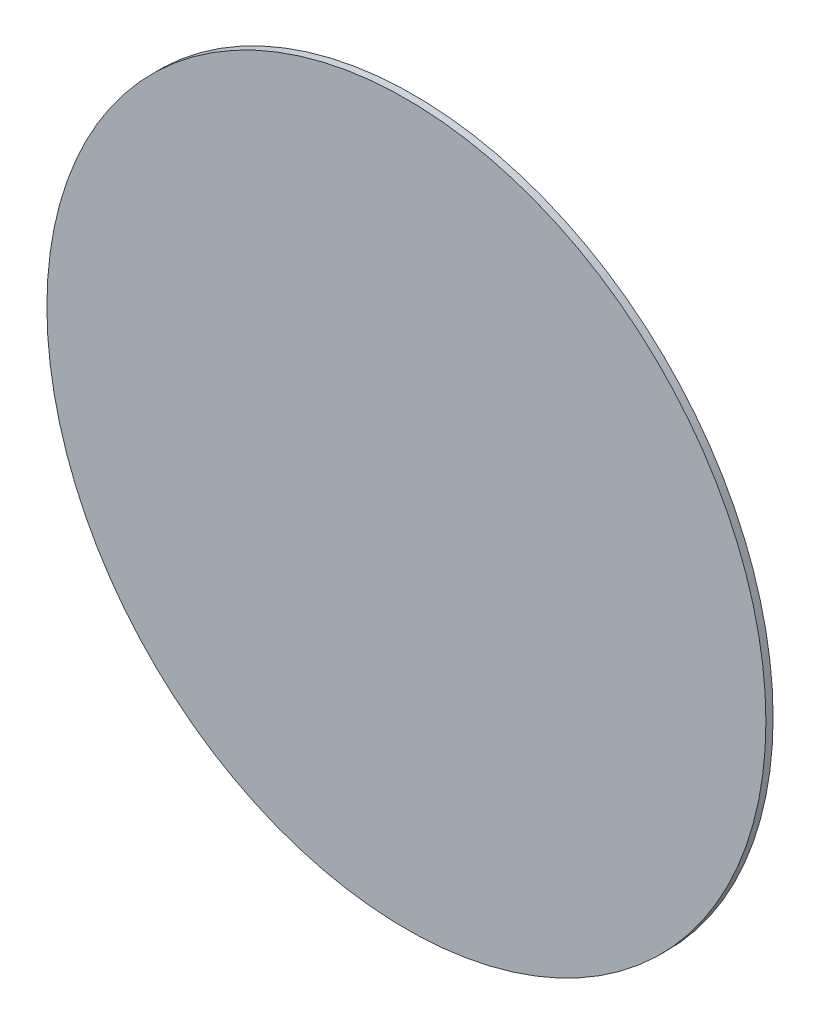
ISO-10303-21;
HEADER;
FILE_DESCRIPTION(('STEP AP214'),'2;1');
FILE_NAME('part.step','',(''),(''),'','','');
FILE_SCHEMA(('AUTOMOTIVE_DESIGN { 1 0 10303 214 1 1 1 1 }'));
ENDSEC;
DATA;
#1=APPLICATION_CONTEXT('core data for automotive mechanical design processes');
#2=APPLICATION_PROTOCOL_DEFINITION('international standard','automotive_design',2000,#1);
#3=PRODUCT_CONTEXT('',#1,'mechanical');
#4=PRODUCT('Part','Part','',(#3));
#5=PRODUCT_RELATED_PRODUCT_CATEGORY('part','',(#4));
#6=PRODUCT_DEFINITION_FORMATION('','',#4);
#7=PRODUCT_DEFINITION_CONTEXT('part definition',#1,'design');
#8=PRODUCT_DEFINITION('design','',#6,#7);
#9=PRODUCT_DEFINITION_SHAPE('','',#8);
#10=(LENGTH_UNIT() NAMED_UNIT(*) SI_UNIT(.MILLI.,.METRE.));
#11=(NAMED_UNIT(*) PLANE_ANGLE_UNIT() SI_UNIT($,.RADIAN.));
#12=(NAMED_UNIT(*) SI_UNIT($,.STERADIAN.) SOLID_ANGLE_UNIT());
#13=UNCERTAINTY_MEASURE_WITH_UNIT(LENGTH_MEASURE(1.E-05),#10,'distance_accuracy_value','');
#14=(GEOMETRIC_REPRESENTATION_CONTEXT(3) GLOBAL_UNCERTAINTY_ASSIGNED_CONTEXT((#13)) GLOBAL_UNIT_ASSIGNED_CONTEXT((#10,
#11,#12)) REPRESENTATION_CONTEXT('',''));
#15=CARTESIAN_POINT('',(0.,0.,0.));
#16=DIRECTION('',(0.,0.,1.));
#17=DIRECTION('',(1.,0.,0.));
#18=AXIS2_PLACEMENT_3D('',#15,#16,#17);
#19=CARTESIAN_POINT('',(0.5,0.,0.));
#20=DIRECTION('',(0.,0.,-1.));
#21=DIRECTION('',(-1.,0.,0.));
#22=AXIS2_PLACEMENT_3D('',#19,#20,#21);
#23=PLANE('',#22);
#24=CARTESIAN_POINT('',(0.,0.,0.));
#25=DIRECTION('',(0.,0.,-1.));
#26=DIRECTION('',(-1.,0.,0.));
#27=AXIS2_PLACEMENT_3D('',#24,#25,#26);
#28=CIRCLE('',#27,0.5);
#29=CARTESIAN_POINT('',(-0.5,0.,0.));
#30=VERTEX_POINT('',#29);
#31=EDGE_CURVE('E18',#30,#30,#28,.F.);
#32=ORIENTED_EDGE('',*,*,#31,.F.);
#33=EDGE_LOOP('',(#32));
#34=FACE_BOUND('',#33,.T.);
#35=ADVANCED_FACE('F15',(#34),#23,.T.);
#36=CARTESIAN_POINT('',(0.,0.,0.));
#37=DIRECTION('',(0.,0.,-1.));
#38=DIRECTION('',(-1.,0.,0.));
#39=AXIS2_PLACEMENT_3D('',#36,#37,#38);
#40=CYLINDRICAL_SURFACE('',#39,0.5);
#41=ORIENTED_EDGE('',*,*,#31,.T.);
#42=EDGE_LOOP('',(#41));
#43=FACE_BOUND('',#42,.T.);
#44=CARTESIAN_POINT('',(0.,0.,0.01));
#45=DIRECTION('',(0.,0.,-1.));
#46=DIRECTION('',(-1.,0.,0.));
#47=AXIS2_PLACEMENT_3D('',#44,#45,#46);
#48=CIRCLE('',#47,0.5);
#49=CARTESIAN_POINT('',(-0.5,0.,0.01));
#50=VERTEX_POINT('',#49);
#51=EDGE_CURVE('E10',#50,#50,#48,.T.);
#52=ORIENTED_EDGE('',*,*,#51,.T.);
#53=EDGE_LOOP('',(#52));
#54=FACE_BOUND('',#53,.T.);
#55=ADVANCED_FACE('F27',(#43,#54),#40,.T.);
#56=CARTESIAN_POINT('',(0.5,0.,0.01));
#57=DIRECTION('',(0.,0.,-1.));
#58=DIRECTION('',(-1.,0.,0.));
#59=AXIS2_PLACEMENT_3D('',#56,#57,#58);
#60=PLANE('',#59);
#61=ORIENTED_EDGE('',*,*,#51,.F.);
#62=EDGE_LOOP('',(#61));
#63=FACE_BOUND('',#62,.T.);
#64=ADVANCED_FACE('F34',(#63),#60,.F.);
#65=CLOSED_SHELL('',(#35,#55,#64));
#66=MANIFOLD_SOLID_BREP('B1',#65);
#67=ADVANCED_BREP_SHAPE_REPRESENTATION('',(#18,#66),#14);
#68=SHAPE_DEFINITION_REPRESENTATION(#9,#67);
ENDSEC;
END-ISO-10303-21;
